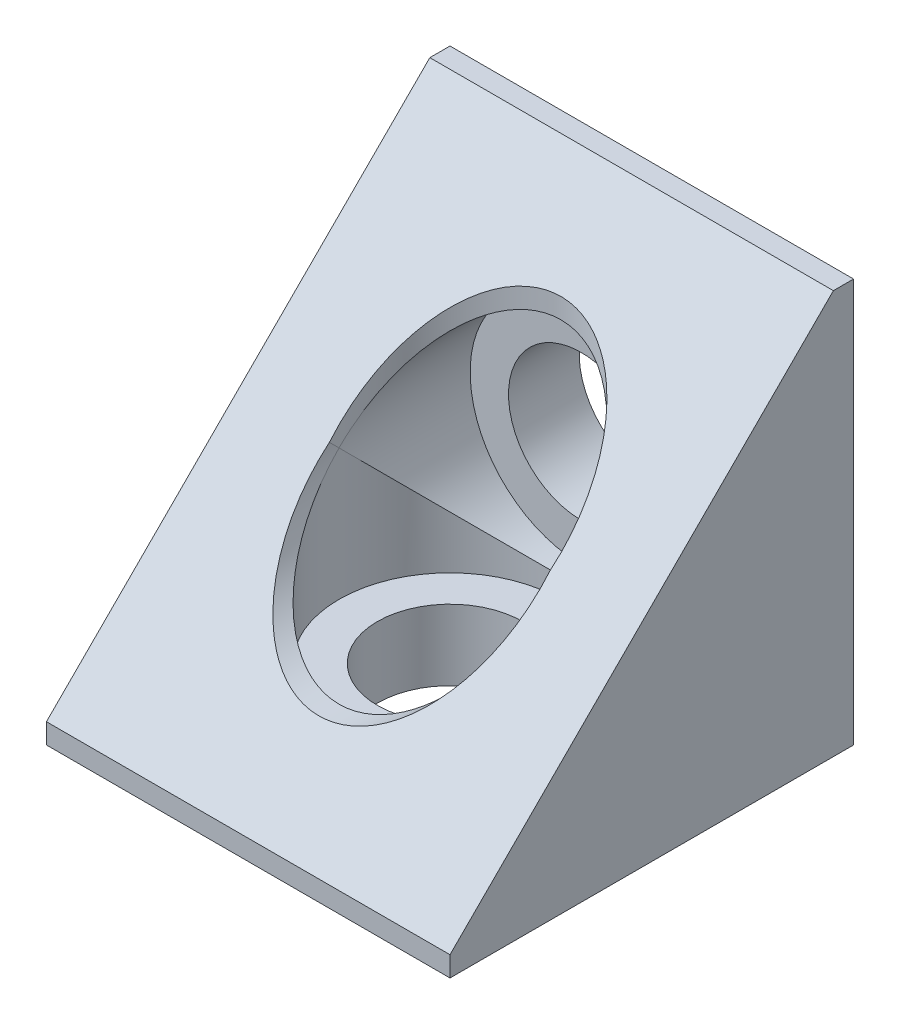
ISO-10303-21;
HEADER;
FILE_DESCRIPTION(('STEP AP214'),'2;1');
FILE_NAME('part.step','',(''),(''),'','','');
FILE_SCHEMA(('AUTOMOTIVE_DESIGN { 1 0 10303 214 1 1 1 1 }'));
ENDSEC;
DATA;
#1=APPLICATION_CONTEXT('core data for automotive mechanical design processes');
#2=APPLICATION_PROTOCOL_DEFINITION('international standard','automotive_design',2000,#1);
#3=PRODUCT_CONTEXT('',#1,'mechanical');
#4=PRODUCT('Part','Part','',(#3));
#5=PRODUCT_RELATED_PRODUCT_CATEGORY('part','',(#4));
#6=PRODUCT_DEFINITION_FORMATION('','',#4);
#7=PRODUCT_DEFINITION_CONTEXT('part definition',#1,'design');
#8=PRODUCT_DEFINITION('design','',#6,#7);
#9=PRODUCT_DEFINITION_SHAPE('','',#8);
#10=(LENGTH_UNIT() NAMED_UNIT(*) SI_UNIT(.MILLI.,.METRE.));
#11=(NAMED_UNIT(*) PLANE_ANGLE_UNIT() SI_UNIT($,.RADIAN.));
#12=(NAMED_UNIT(*) SI_UNIT($,.STERADIAN.) SOLID_ANGLE_UNIT());
#13=UNCERTAINTY_MEASURE_WITH_UNIT(LENGTH_MEASURE(1.E-05),#10,'distance_accuracy_value','');
#14=(GEOMETRIC_REPRESENTATION_CONTEXT(3) GLOBAL_UNCERTAINTY_ASSIGNED_CONTEXT((#13)) GLOBAL_UNIT_ASSIGNED_CONTEXT((#10,
#11,#12)) REPRESENTATION_CONTEXT('',''));
#15=CARTESIAN_POINT('',(0.,0.,0.));
#16=DIRECTION('',(0.,0.,1.));
#17=DIRECTION('',(1.,0.,0.));
#18=AXIS2_PLACEMENT_3D('',#15,#16,#17);
#19=CARTESIAN_POINT('',(0.,0.,-6.5));
#20=DIRECTION('',(0.,0.,1.));
#21=DIRECTION('',(1.,0.,0.));
#22=AXIS2_PLACEMENT_3D('',#19,#20,#21);
#23=CYLINDRICAL_SURFACE('',#22,5.5);
#24=CARTESIAN_POINT('',(0.,0.,0.));
#25=DIRECTION('',(0.,-0.707106781186547,0.707106781186547));
#26=DIRECTION('',(0.,0.707106781186547,0.707106781186547));
#27=AXIS2_PLACEMENT_3D('',#24,#25,#26);
#28=ELLIPSE('',#27,7.77817459305202,5.5);
#29=CARTESIAN_POINT('',(-5.5,0.,0.));
#30=VERTEX_POINT('',#29);
#31=CARTESIAN_POINT('',(-5.47722557505165,0.500000000000052,0.500000000000055));
#32=VERTEX_POINT('',#31);
#33=EDGE_CURVE('E160',#30,#32,#28,.F.);
#34=ORIENTED_EDGE('',*,*,#33,.T.);
#35=CARTESIAN_POINT('',(0.,0.,1.0000000000001));
#36=DIRECTION('',(0.,-0.707106781186544,-0.707106781186552));
#37=DIRECTION('',(0.,-0.707106781186552,0.707106781186544));
#38=AXIS2_PLACEMENT_3D('',#35,#36,#37);
#39=ELLIPSE('',#38,7.77817459305198,5.5);
#40=CARTESIAN_POINT('',(5.47722557505166,0.500000000000053,0.500000000000053));
#41=VERTEX_POINT('',#40);
#42=EDGE_CURVE('E69',#32,#41,#39,.F.);
#43=ORIENTED_EDGE('',*,*,#42,.T.);
#44=CARTESIAN_POINT('',(5.5,0.,0.));
#45=VERTEX_POINT('',#44);
#46=EDGE_CURVE('E150',#41,#45,#28,.F.);
#47=ORIENTED_EDGE('',*,*,#46,.T.);
#48=CARTESIAN_POINT('',(0.,0.,0.));
#49=DIRECTION('',(0.,0.707106781186547,0.707106781186547));
#50=DIRECTION('',(0.,-0.707106781186547,0.707106781186547));
#51=AXIS2_PLACEMENT_3D('',#48,#49,#50);
#52=ELLIPSE('',#51,7.77817459305202,5.5);
#53=EDGE_CURVE('E55',#45,#30,#52,.F.);
#54=ORIENTED_EDGE('',*,*,#53,.T.);
#55=EDGE_LOOP('',(#34,#43,#47,#54));
#56=FACE_BOUND('',#55,.T.);
#57=ADVANCED_FACE('F47',(#56),#23,.F.);
#58=CARTESIAN_POINT('',(0.,-10.,0.));
#59=DIRECTION('',(0.,1.,0.));
#60=DIRECTION('',(-1.,0.,0.));
#61=AXIS2_PLACEMENT_3D('',#58,#59,#60);
#62=CYLINDRICAL_SURFACE('',#61,3.6);
#63=CARTESIAN_POINT('',(0.,-10.,0.));
#64=DIRECTION('',(0.,1.,0.));
#65=DIRECTION('',(-1.,0.,0.));
#66=AXIS2_PLACEMENT_3D('',#63,#64,#65);
#67=CIRCLE('',#66,3.6);
#68=CARTESIAN_POINT('',(-3.6,-10.,0.));
#69=VERTEX_POINT('',#68);
#70=EDGE_CURVE('E158',#69,#69,#67,.T.);
#71=ORIENTED_EDGE('',*,*,#70,.F.);
#72=EDGE_LOOP('',(#71));
#73=FACE_BOUND('',#72,.T.);
#74=CARTESIAN_POINT('',(0.,-6.5,0.));
#75=DIRECTION('',(0.,1.,0.));
#76=DIRECTION('',(-1.,0.,0.));
#77=AXIS2_PLACEMENT_3D('',#74,#75,#76);
#78=CIRCLE('',#77,3.6);
#79=CARTESIAN_POINT('',(-3.6,-6.50000000000001,0.));
#80=VERTEX_POINT('',#79);
#81=EDGE_CURVE('E155',#80,#80,#78,.F.);
#82=ORIENTED_EDGE('',*,*,#81,.F.);
#83=EDGE_LOOP('',(#82));
#84=FACE_BOUND('',#83,.T.);
#85=ADVANCED_FACE('F205',(#73,#84),#62,.F.);
#86=CARTESIAN_POINT('',(0.,0.,10.));
#87=DIRECTION('',(0.,0.,-1.));
#88=DIRECTION('',(-1.,0.,0.));
#89=AXIS2_PLACEMENT_3D('',#86,#87,#88);
#90=CYLINDRICAL_SURFACE('',#89,3.6);
#91=CARTESIAN_POINT('',(0.,0.,-10.));
#92=DIRECTION('',(0.,0.,1.));
#93=DIRECTION('',(1.,0.,0.));
#94=AXIS2_PLACEMENT_3D('',#91,#92,#93);
#95=CIRCLE('',#94,3.6);
#96=CARTESIAN_POINT('',(3.6,0.,-10.));
#97=VERTEX_POINT('',#96);
#98=EDGE_CURVE('E132',#97,#97,#95,.T.);
#99=ORIENTED_EDGE('',*,*,#98,.F.);
#100=EDGE_LOOP('',(#99));
#101=FACE_BOUND('',#100,.T.);
#102=CARTESIAN_POINT('',(0.,0.,-6.5));
#103=DIRECTION('',(0.,0.,1.));
#104=DIRECTION('',(1.,0.,0.));
#105=AXIS2_PLACEMENT_3D('',#102,#103,#104);
#106=CIRCLE('',#105,3.6);
#107=CARTESIAN_POINT('',(3.6,0.,-6.5));
#108=VERTEX_POINT('',#107);
#109=EDGE_CURVE('E151',#108,#108,#106,.T.);
#110=ORIENTED_EDGE('',*,*,#109,.T.);
#111=EDGE_LOOP('',(#110));
#112=FACE_BOUND('',#111,.T.);
#113=ADVANCED_FACE('F209',(#101,#112),#90,.F.);
#114=CARTESIAN_POINT('',(0.,0.,10.));
#115=DIRECTION('',(0.,0.,1.));
#116=DIRECTION('',(1.,0.,0.));
#117=AXIS2_PLACEMENT_3D('',#114,#115,#116);
#118=PLANE('',#117);
#119=DIRECTION('',(1.,0.,0.));
#120=VECTOR('',#119,1.);
#121=CARTESIAN_POINT('',(-9.99999999999999,-9.,10.));
#122=LINE('',#121,#120);
#123=CARTESIAN_POINT('',(-9.99999999999999,-9.,10.));
#124=VERTEX_POINT('',#123);
#125=CARTESIAN_POINT('',(10.,-9.,10.));
#126=VERTEX_POINT('',#125);
#127=EDGE_CURVE('E106',#124,#126,#122,.T.);
#128=ORIENTED_EDGE('',*,*,#127,.F.);
#129=DIRECTION('',(0.,-1.,0.));
#130=VECTOR('',#129,1.);
#131=CARTESIAN_POINT('',(-10.,-10.,10.));
#132=LINE('',#131,#130);
#133=CARTESIAN_POINT('',(-10.,-10.,10.));
#134=VERTEX_POINT('',#133);
#135=EDGE_CURVE('E115',#124,#134,#132,.T.);
#136=ORIENTED_EDGE('',*,*,#135,.T.);
#137=DIRECTION('',(1.,0.,0.));
#138=VECTOR('',#137,1.);
#139=CARTESIAN_POINT('',(10.,-10.,10.));
#140=LINE('',#139,#138);
#141=CARTESIAN_POINT('',(10.,-10.,10.));
#142=VERTEX_POINT('',#141);
#143=EDGE_CURVE('E124',#134,#142,#140,.T.);
#144=ORIENTED_EDGE('',*,*,#143,.T.);
#145=DIRECTION('',(0.,1.,0.));
#146=VECTOR('',#145,1.);
#147=CARTESIAN_POINT('',(10.,-10.,10.));
#148=LINE('',#147,#146);
#149=EDGE_CURVE('E118',#142,#126,#148,.T.);
#150=ORIENTED_EDGE('',*,*,#149,.T.);
#151=EDGE_LOOP('',(#128,#136,#144,#150));
#152=FACE_BOUND('',#151,.T.);
#153=ADVANCED_FACE('F114',(#152),#118,.T.);
#154=CARTESIAN_POINT('',(0.,0.,-10.));
#155=DIRECTION('',(0.,0.,1.));
#156=DIRECTION('',(1.,0.,0.));
#157=AXIS2_PLACEMENT_3D('',#154,#155,#156);
#158=PLANE('',#157);
#159=DIRECTION('',(0.,-1.,0.));
#160=VECTOR('',#159,1.);
#161=CARTESIAN_POINT('',(-10.,-10.,-10.));
#162=LINE('',#161,#160);
#163=CARTESIAN_POINT('',(-10.,9.99999999999999,-10.));
#164=VERTEX_POINT('',#163);
#165=CARTESIAN_POINT('',(-10.,-10.,-10.));
#166=VERTEX_POINT('',#165);
#167=EDGE_CURVE('E137',#164,#166,#162,.T.);
#168=ORIENTED_EDGE('',*,*,#167,.F.);
#169=DIRECTION('',(-1.,0.,0.));
#170=VECTOR('',#169,1.);
#171=CARTESIAN_POINT('',(10.,10.,-10.));
#172=LINE('',#171,#170);
#173=CARTESIAN_POINT('',(10.,10.,-10.));
#174=VERTEX_POINT('',#173);
#175=EDGE_CURVE('E125',#174,#164,#172,.T.);
#176=ORIENTED_EDGE('',*,*,#175,.F.);
#177=DIRECTION('',(0.,1.,0.));
#178=VECTOR('',#177,1.);
#179=CARTESIAN_POINT('',(10.,-10.,-10.));
#180=LINE('',#179,#178);
#181=CARTESIAN_POINT('',(10.,-10.,-10.));
#182=VERTEX_POINT('',#181);
#183=EDGE_CURVE('E129',#182,#174,#180,.T.);
#184=ORIENTED_EDGE('',*,*,#183,.F.);
#185=DIRECTION('',(1.,0.,0.));
#186=VECTOR('',#185,1.);
#187=CARTESIAN_POINT('',(10.,-10.,-10.));
#188=LINE('',#187,#186);
#189=EDGE_CURVE('E139',#166,#182,#188,.T.);
#190=ORIENTED_EDGE('',*,*,#189,.F.);
#191=EDGE_LOOP('',(#168,#176,#184,#190));
#192=FACE_BOUND('',#191,.T.);
#193=ORIENTED_EDGE('',*,*,#98,.T.);
#194=EDGE_LOOP('',(#193));
#195=FACE_BOUND('',#194,.T.);
#196=ADVANCED_FACE('F291',(#192,#195),#158,.F.);
#197=CARTESIAN_POINT('',(-10.,-10.,10.));
#198=DIRECTION('',(1.,0.,0.));
#199=DIRECTION('',(0.,0.,-1.));
#200=AXIS2_PLACEMENT_3D('',#197,#198,#199);
#201=PLANE('',#200);
#202=ORIENTED_EDGE('',*,*,#135,.F.);
#203=DIRECTION('',(0.,0.707106781186552,-0.707106781186544));
#204=VECTOR('',#203,1.);
#205=CARTESIAN_POINT('',(-9.99999999999999,-9.,10.));
#206=LINE('',#205,#204);
#207=CARTESIAN_POINT('',(-9.99999999999999,10.,-8.99999999999979));
#208=VERTEX_POINT('',#207);
#209=EDGE_CURVE('E103',#124,#208,#206,.T.);
#210=ORIENTED_EDGE('',*,*,#209,.T.);
#211=DIRECTION('',(0.,0.,-1.));
#212=VECTOR('',#211,1.);
#213=CARTESIAN_POINT('',(-10.,9.99999999999999,10.));
#214=LINE('',#213,#212);
#215=EDGE_CURVE('E136',#208,#164,#214,.T.);
#216=ORIENTED_EDGE('',*,*,#215,.T.);
#217=ORIENTED_EDGE('',*,*,#167,.T.);
#218=DIRECTION('',(0.,0.,-1.));
#219=VECTOR('',#218,1.);
#220=CARTESIAN_POINT('',(-10.,-10.,10.));
#221=LINE('',#220,#219);
#222=EDGE_CURVE('E123',#134,#166,#221,.T.);
#223=ORIENTED_EDGE('',*,*,#222,.F.);
#224=EDGE_LOOP('',(#202,#210,#216,#217,#223));
#225=FACE_BOUND('',#224,.T.);
#226=ADVANCED_FACE('F49',(#225),#201,.F.);
#227=CARTESIAN_POINT('',(10.,-10.,10.));
#228=DIRECTION('',(0.,1.,0.));
#229=DIRECTION('',(-1.,0.,0.));
#230=AXIS2_PLACEMENT_3D('',#227,#228,#229);
#231=PLANE('',#230);
#232=ORIENTED_EDGE('',*,*,#70,.T.);
#233=EDGE_LOOP('',(#232));
#234=FACE_BOUND('',#233,.T.);
#235=ORIENTED_EDGE('',*,*,#189,.T.);
#236=DIRECTION('',(0.,0.,-1.));
#237=VECTOR('',#236,1.);
#238=CARTESIAN_POINT('',(10.,-10.,10.));
#239=LINE('',#238,#237);
#240=EDGE_CURVE('E146',#142,#182,#239,.T.);
#241=ORIENTED_EDGE('',*,*,#240,.F.);
#242=ORIENTED_EDGE('',*,*,#143,.F.);
#243=ORIENTED_EDGE('',*,*,#222,.T.);
#244=EDGE_LOOP('',(#235,#241,#242,#243));
#245=FACE_BOUND('',#244,.T.);
#246=ADVANCED_FACE('F256',(#234,#245),#231,.F.);
#247=CARTESIAN_POINT('',(10.,-10.,10.));
#248=DIRECTION('',(-1.,0.,0.));
#249=DIRECTION('',(0.,0.,1.));
#250=AXIS2_PLACEMENT_3D('',#247,#248,#249);
#251=PLANE('',#250);
#252=DIRECTION('',(0.,0.,-1.));
#253=VECTOR('',#252,1.);
#254=CARTESIAN_POINT('',(10.,10.,10.));
#255=LINE('',#254,#253);
#256=CARTESIAN_POINT('',(10.,10.,-8.99999999999979));
#257=VERTEX_POINT('',#256);
#258=EDGE_CURVE('E144',#257,#174,#255,.T.);
#259=ORIENTED_EDGE('',*,*,#258,.F.);
#260=DIRECTION('',(0.,0.707106781186552,-0.707106781186544));
#261=VECTOR('',#260,1.);
#262=CARTESIAN_POINT('',(10.,-9.,10.));
#263=LINE('',#262,#261);
#264=EDGE_CURVE('E62',#126,#257,#263,.T.);
#265=ORIENTED_EDGE('',*,*,#264,.F.);
#266=ORIENTED_EDGE('',*,*,#149,.F.);
#267=ORIENTED_EDGE('',*,*,#240,.T.);
#268=ORIENTED_EDGE('',*,*,#183,.T.);
#269=EDGE_LOOP('',(#259,#265,#266,#267,#268));
#270=FACE_BOUND('',#269,.T.);
#271=ADVANCED_FACE('F200',(#270),#251,.F.);
#272=CARTESIAN_POINT('',(10.,10.,10.));
#273=DIRECTION('',(0.,-1.,0.));
#274=DIRECTION('',(1.,0.,0.));
#275=AXIS2_PLACEMENT_3D('',#272,#273,#274);
#276=PLANE('',#275);
#277=ORIENTED_EDGE('',*,*,#215,.F.);
#278=DIRECTION('',(1.,0.,0.));
#279=VECTOR('',#278,1.);
#280=CARTESIAN_POINT('',(-9.99999999999999,10.,-8.99999999999979));
#281=LINE('',#280,#279);
#282=EDGE_CURVE('E107',#208,#257,#281,.T.);
#283=ORIENTED_EDGE('',*,*,#282,.T.);
#284=ORIENTED_EDGE('',*,*,#258,.T.);
#285=ORIENTED_EDGE('',*,*,#175,.T.);
#286=EDGE_LOOP('',(#277,#283,#284,#285));
#287=FACE_BOUND('',#286,.T.);
#288=ADVANCED_FACE('F191',(#287),#276,.F.);
#289=CARTESIAN_POINT('',(0.,0.,0.));
#290=DIRECTION('',(0.,-0.707106781186547,0.707106781186547));
#291=DIRECTION('',(0.,0.707106781186547,0.707106781186547));
#292=AXIS2_PLACEMENT_3D('',#289,#290,#291);
#293=ELLIPSE('',#292,7.77817459305202,5.5);
#294=EDGE_CURVE('E163',#30,#45,#293,.T.);
#295=ORIENTED_EDGE('',*,*,#294,.T.);
#296=CARTESIAN_POINT('',(0.,0.,0.));
#297=DIRECTION('',(0.,0.707106781186547,0.707106781186547));
#298=DIRECTION('',(0.,-0.707106781186547,0.707106781186547));
#299=AXIS2_PLACEMENT_3D('',#296,#297,#298);
#300=ELLIPSE('',#299,7.77817459305202,5.5);
#301=EDGE_CURVE('E166',#45,#30,#300,.T.);
#302=ORIENTED_EDGE('',*,*,#301,.T.);
#303=EDGE_LOOP('',(#295,#302));
#304=FACE_BOUND('',#303,.T.);
#305=CARTESIAN_POINT('',(0.,0.,-6.5));
#306=DIRECTION('',(0.,0.,1.));
#307=DIRECTION('',(1.,0.,0.));
#308=AXIS2_PLACEMENT_3D('',#305,#306,#307);
#309=CIRCLE('',#308,5.5);
#310=CARTESIAN_POINT('',(5.5,0.,-6.5));
#311=VERTEX_POINT('',#310);
#312=EDGE_CURVE('E154',#311,#311,#309,.T.);
#313=ORIENTED_EDGE('',*,*,#312,.F.);
#314=EDGE_LOOP('',(#313));
#315=FACE_BOUND('',#314,.T.);
#316=ADVANCED_FACE('F176',(#304,#315),#23,.F.);
#317=CARTESIAN_POINT('',(0.,0.,-6.5));
#318=DIRECTION('',(0.,0.,1.));
#319=DIRECTION('',(1.,0.,0.));
#320=AXIS2_PLACEMENT_3D('',#317,#318,#319);
#321=PLANE('',#320);
#322=ORIENTED_EDGE('',*,*,#109,.F.);
#323=EDGE_LOOP('',(#322));
#324=FACE_BOUND('',#323,.T.);
#325=ORIENTED_EDGE('',*,*,#312,.T.);
#326=EDGE_LOOP('',(#325));
#327=FACE_BOUND('',#326,.T.);
#328=ADVANCED_FACE('F189',(#324,#327),#321,.T.);
#329=CARTESIAN_POINT('',(0.,-6.5,0.));
#330=DIRECTION('',(0.,1.,0.));
#331=DIRECTION('',(-1.,0.,0.));
#332=AXIS2_PLACEMENT_3D('',#329,#330,#331);
#333=PLANE('',#332);
#334=CARTESIAN_POINT('',(0.,-6.5,0.));
#335=DIRECTION('',(0.,1.,0.));
#336=DIRECTION('',(-1.,0.,0.));
#337=AXIS2_PLACEMENT_3D('',#334,#335,#336);
#338=CIRCLE('',#337,5.5);
#339=CARTESIAN_POINT('',(-5.5,-6.50000000000001,0.));
#340=VERTEX_POINT('',#339);
#341=EDGE_CURVE('E159',#340,#340,#338,.T.);
#342=ORIENTED_EDGE('',*,*,#341,.T.);
#343=EDGE_LOOP('',(#342));
#344=FACE_BOUND('',#343,.T.);
#345=ORIENTED_EDGE('',*,*,#81,.T.);
#346=EDGE_LOOP('',(#345));
#347=FACE_BOUND('',#346,.T.);
#348=ADVANCED_FACE('F197',(#344,#347),#333,.T.);
#349=CARTESIAN_POINT('',(0.,-6.5,0.));
#350=DIRECTION('',(0.,1.,0.));
#351=DIRECTION('',(-1.,0.,0.));
#352=AXIS2_PLACEMENT_3D('',#349,#350,#351);
#353=CYLINDRICAL_SURFACE('',#352,5.5);
#354=ORIENTED_EDGE('',*,*,#341,.F.);
#355=EDGE_LOOP('',(#354));
#356=FACE_BOUND('',#355,.T.);
#357=ORIENTED_EDGE('',*,*,#294,.F.);
#358=ORIENTED_EDGE('',*,*,#53,.F.);
#359=EDGE_LOOP('',(#357,#358));
#360=FACE_BOUND('',#359,.T.);
#361=ADVANCED_FACE('F219',(#356,#360),#353,.F.);
#362=ORIENTED_EDGE('',*,*,#46,.F.);
#363=CARTESIAN_POINT('',(0.,1.00000000000011,0.));
#364=DIRECTION('',(0.,-0.707106781186544,-0.707106781186552));
#365=DIRECTION('',(0.,0.707106781186552,-0.707106781186544));
#366=AXIS2_PLACEMENT_3D('',#363,#364,#365);
#367=ELLIPSE('',#366,7.77817459305207,5.5);
#368=EDGE_CURVE('E13',#41,#32,#367,.F.);
#369=ORIENTED_EDGE('',*,*,#368,.T.);
#370=ORIENTED_EDGE('',*,*,#33,.F.);
#371=ORIENTED_EDGE('',*,*,#301,.F.);
#372=EDGE_LOOP('',(#362,#369,#370,#371));
#373=FACE_BOUND('',#372,.T.);
#374=ADVANCED_FACE('F179',(#373),#353,.F.);
#375=CARTESIAN_POINT('',(-9.99999999999999,-9.,10.));
#376=DIRECTION('',(0.,-0.707106781186544,-0.707106781186552));
#377=DIRECTION('',(0.,0.707106781186552,-0.707106781186544));
#378=AXIS2_PLACEMENT_3D('',#375,#376,#377);
#379=PLANE('',#378);
#380=ORIENTED_EDGE('',*,*,#264,.T.);
#381=ORIENTED_EDGE('',*,*,#282,.F.);
#382=ORIENTED_EDGE('',*,*,#209,.F.);
#383=ORIENTED_EDGE('',*,*,#127,.T.);
#384=EDGE_LOOP('',(#380,#381,#382,#383));
#385=FACE_BOUND('',#384,.T.);
#386=ORIENTED_EDGE('',*,*,#368,.F.);
#387=ORIENTED_EDGE('',*,*,#42,.F.);
#388=EDGE_LOOP('',(#386,#387));
#389=FACE_BOUND('',#388,.T.);
#390=ADVANCED_FACE('F105',(#385,#389),#379,.F.);
#391=CLOSED_SHELL('',(#57,#85,#113,#153,#196,#226,#246,#271,#288,#316,#328,#348,#361,#374,#390));
#392=MANIFOLD_SOLID_BREP('B2',#391);
#393=ADVANCED_BREP_SHAPE_REPRESENTATION('',(#18,#392),#14);
#394=SHAPE_DEFINITION_REPRESENTATION(#9,#393);
ENDSEC;
END-ISO-10303-21;
